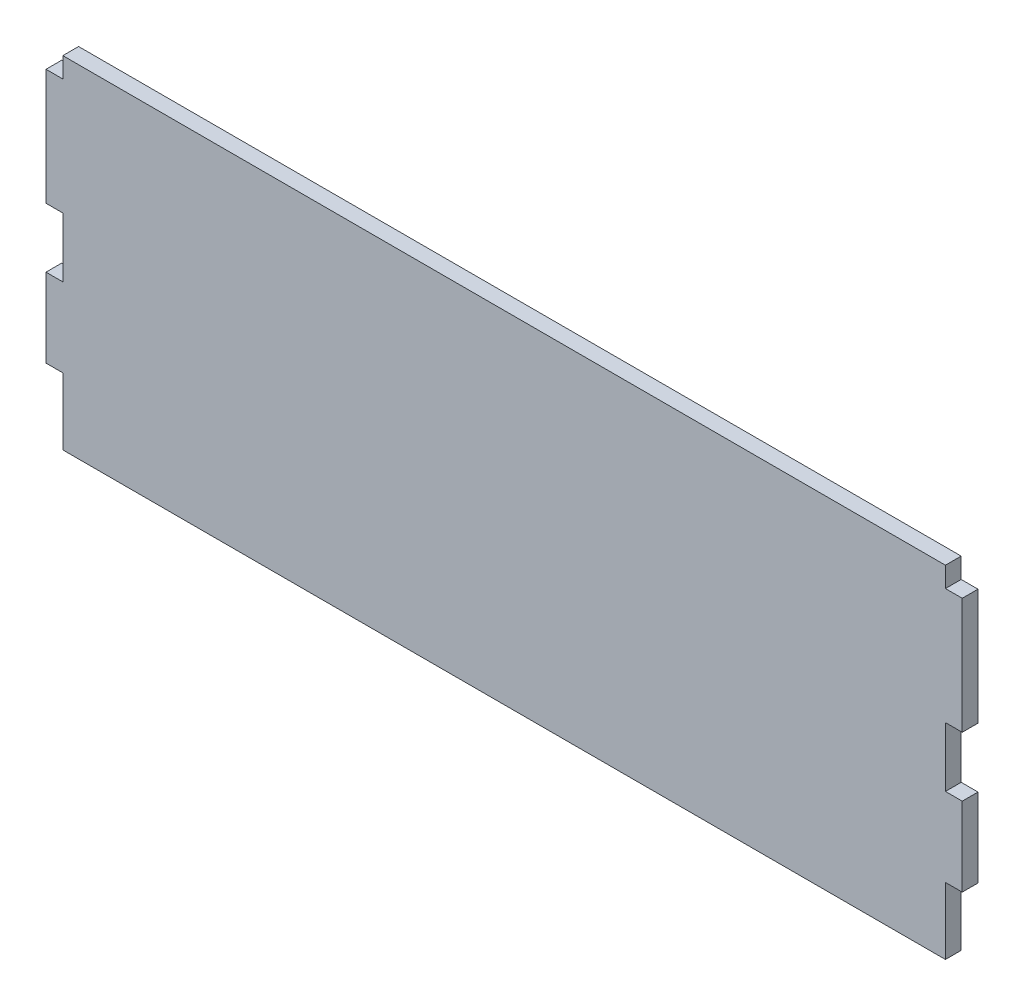
ISO-10303-21;
HEADER;
FILE_DESCRIPTION(('STEP AP214'),'2;1');
FILE_NAME('part.step','',(''),(''),'','','');
FILE_SCHEMA(('AUTOMOTIVE_DESIGN { 1 0 10303 214 1 1 1 1 }'));
ENDSEC;
DATA;
#1=APPLICATION_CONTEXT('core data for automotive mechanical design processes');
#2=APPLICATION_PROTOCOL_DEFINITION('international standard','automotive_design',2000,#1);
#3=PRODUCT_CONTEXT('',#1,'mechanical');
#4=PRODUCT('Part','Part','',(#3));
#5=PRODUCT_RELATED_PRODUCT_CATEGORY('part','',(#4));
#6=PRODUCT_DEFINITION_FORMATION('','',#4);
#7=PRODUCT_DEFINITION_CONTEXT('part definition',#1,'design');
#8=PRODUCT_DEFINITION('design','',#6,#7);
#9=PRODUCT_DEFINITION_SHAPE('','',#8);
#10=(LENGTH_UNIT() NAMED_UNIT(*) SI_UNIT(.MILLI.,.METRE.));
#11=(NAMED_UNIT(*) PLANE_ANGLE_UNIT() SI_UNIT($,.RADIAN.));
#12=(NAMED_UNIT(*) SI_UNIT($,.STERADIAN.) SOLID_ANGLE_UNIT());
#13=UNCERTAINTY_MEASURE_WITH_UNIT(LENGTH_MEASURE(1.E-05),#10,'distance_accuracy_value','');
#14=(GEOMETRIC_REPRESENTATION_CONTEXT(3) GLOBAL_UNCERTAINTY_ASSIGNED_CONTEXT((#13)) GLOBAL_UNIT_ASSIGNED_CONTEXT((#10,
#11,#12)) REPRESENTATION_CONTEXT('',''));
#15=CARTESIAN_POINT('',(0.,0.,0.));
#16=DIRECTION('',(0.,0.,1.));
#17=DIRECTION('',(1.,0.,0.));
#18=AXIS2_PLACEMENT_3D('',#15,#16,#17);
#19=CARTESIAN_POINT('',(-84.,11.1478908984833,3.));
#20=DIRECTION('',(1.,0.,0.));
#21=DIRECTION('',(0.,0.,-1.));
#22=AXIS2_PLACEMENT_3D('',#19,#20,#21);
#23=PLANE('',#22);
#24=DIRECTION('',(0.,-1.,0.));
#25=VECTOR('',#24,1.);
#26=CARTESIAN_POINT('',(-84.,11.1478908984833,3.));
#27=LINE('',#26,#25);
#28=CARTESIAN_POINT('',(-84.,14.9988424174287,3.));
#29=VERTEX_POINT('',#28);
#30=CARTESIAN_POINT('',(-84.,11.1478908984833,3.));
#31=VERTEX_POINT('',#30);
#32=EDGE_CURVE('E137',#29,#31,#27,.T.);
#33=ORIENTED_EDGE('',*,*,#32,.F.);
#34=DIRECTION('',(0.,0.,-1.));
#35=VECTOR('',#34,1.);
#36=CARTESIAN_POINT('',(-84.,14.9988424174287,3.));
#37=LINE('',#36,#35);
#38=CARTESIAN_POINT('',(-84.,14.9988424174287,0.));
#39=VERTEX_POINT('',#38);
#40=EDGE_CURVE('E222',#29,#39,#37,.T.);
#41=ORIENTED_EDGE('',*,*,#40,.T.);
#42=DIRECTION('',(0.,-1.,0.));
#43=VECTOR('',#42,1.);
#44=CARTESIAN_POINT('',(-84.,11.1478908984833,0.));
#45=LINE('',#44,#43);
#46=CARTESIAN_POINT('',(-84.,11.1478908984833,0.));
#47=VERTEX_POINT('',#46);
#48=EDGE_CURVE('E218',#39,#47,#45,.T.);
#49=ORIENTED_EDGE('',*,*,#48,.T.);
#50=DIRECTION('',(0.,0.,-1.));
#51=VECTOR('',#50,1.);
#52=CARTESIAN_POINT('',(-84.,11.1478908984833,3.));
#53=LINE('',#52,#51);
#54=EDGE_CURVE('E51',#31,#47,#53,.T.);
#55=ORIENTED_EDGE('',*,*,#54,.F.);
#56=EDGE_LOOP('',(#33,#41,#49,#55));
#57=FACE_BOUND('',#56,.T.);
#58=ADVANCED_FACE('F43',(#57),#23,.F.);
#59=CARTESIAN_POINT('',(-84.,11.1478908984833,3.));
#60=DIRECTION('',(0.,-1.,0.));
#61=DIRECTION('',(0.,0.,-1.));
#62=AXIS2_PLACEMENT_3D('',#59,#60,#61);
#63=PLANE('',#62);
#64=DIRECTION('',(-1.,0.,0.));
#65=VECTOR('',#64,1.);
#66=CARTESIAN_POINT('',(-84.,11.1478908984833,0.));
#67=LINE('',#66,#65);
#68=CARTESIAN_POINT('',(-87.2,11.1478908984833,0.));
#69=VERTEX_POINT('',#68);
#70=EDGE_CURVE('E221',#47,#69,#67,.T.);
#71=ORIENTED_EDGE('',*,*,#70,.T.);
#72=DIRECTION('',(0.,0.,-1.));
#73=VECTOR('',#72,1.);
#74=CARTESIAN_POINT('',(-87.2,11.1478908984833,3.));
#75=LINE('',#74,#73);
#76=CARTESIAN_POINT('',(-87.2,11.1478908984833,3.));
#77=VERTEX_POINT('',#76);
#78=EDGE_CURVE('E329',#77,#69,#75,.T.);
#79=ORIENTED_EDGE('',*,*,#78,.F.);
#80=DIRECTION('',(-1.,0.,0.));
#81=VECTOR('',#80,1.);
#82=CARTESIAN_POINT('',(-84.,11.1478908984833,3.));
#83=LINE('',#82,#81);
#84=EDGE_CURVE('E339',#31,#77,#83,.T.);
#85=ORIENTED_EDGE('',*,*,#84,.F.);
#86=ORIENTED_EDGE('',*,*,#54,.T.);
#87=EDGE_LOOP('',(#71,#79,#85,#86));
#88=FACE_BOUND('',#87,.T.);
#89=ADVANCED_FACE('F337',(#88),#63,.F.);
#90=CARTESIAN_POINT('',(-87.2,11.1478908984833,3.));
#91=DIRECTION('',(1.,0.,0.));
#92=DIRECTION('',(0.,0.,-1.));
#93=AXIS2_PLACEMENT_3D('',#90,#91,#92);
#94=PLANE('',#93);
#95=DIRECTION('',(0.,-1.,0.));
#96=VECTOR('',#95,1.);
#97=CARTESIAN_POINT('',(-87.2,11.1478908984833,0.));
#98=LINE('',#97,#96);
#99=CARTESIAN_POINT('',(-87.2,-10.9453908984831,0.));
#100=VERTEX_POINT('',#99);
#101=EDGE_CURVE('E225',#69,#100,#98,.T.);
#102=ORIENTED_EDGE('',*,*,#101,.T.);
#103=DIRECTION('',(0.,0.,-1.));
#104=VECTOR('',#103,1.);
#105=CARTESIAN_POINT('',(-87.2,-10.9453908984831,3.));
#106=LINE('',#105,#104);
#107=CARTESIAN_POINT('',(-87.2,-10.9453908984831,3.));
#108=VERTEX_POINT('',#107);
#109=EDGE_CURVE('E325',#108,#100,#106,.T.);
#110=ORIENTED_EDGE('',*,*,#109,.F.);
#111=DIRECTION('',(0.,-1.,0.));
#112=VECTOR('',#111,1.);
#113=CARTESIAN_POINT('',(-87.2,11.1478908984833,3.));
#114=LINE('',#113,#112);
#115=EDGE_CURVE('E359',#77,#108,#114,.T.);
#116=ORIENTED_EDGE('',*,*,#115,.F.);
#117=ORIENTED_EDGE('',*,*,#78,.T.);
#118=EDGE_LOOP('',(#102,#110,#116,#117));
#119=FACE_BOUND('',#118,.T.);
#120=ADVANCED_FACE('F349',(#119),#94,.F.);
#121=CARTESIAN_POINT('',(-87.2,-10.9453908984831,3.));
#122=DIRECTION('',(0.,1.,0.));
#123=DIRECTION('',(0.,0.,1.));
#124=AXIS2_PLACEMENT_3D('',#121,#122,#123);
#125=PLANE('',#124);
#126=DIRECTION('',(1.,0.,0.));
#127=VECTOR('',#126,1.);
#128=CARTESIAN_POINT('',(-87.2,-10.9453908984831,0.));
#129=LINE('',#128,#127);
#130=CARTESIAN_POINT('',(-84.,-10.9453908984831,0.));
#131=VERTEX_POINT('',#130);
#132=EDGE_CURVE('E228',#100,#131,#129,.T.);
#133=ORIENTED_EDGE('',*,*,#132,.T.);
#134=DIRECTION('',(0.,0.,-1.));
#135=VECTOR('',#134,1.);
#136=CARTESIAN_POINT('',(-84.,-10.9453908984831,3.));
#137=LINE('',#136,#135);
#138=CARTESIAN_POINT('',(-84.,-10.9453908984831,3.));
#139=VERTEX_POINT('',#138);
#140=EDGE_CURVE('E321',#139,#131,#137,.T.);
#141=ORIENTED_EDGE('',*,*,#140,.F.);
#142=DIRECTION('',(1.,0.,0.));
#143=VECTOR('',#142,1.);
#144=CARTESIAN_POINT('',(-87.2,-10.9453908984831,3.));
#145=LINE('',#144,#143);
#146=EDGE_CURVE('E355',#108,#139,#145,.T.);
#147=ORIENTED_EDGE('',*,*,#146,.F.);
#148=ORIENTED_EDGE('',*,*,#109,.T.);
#149=EDGE_LOOP('',(#133,#141,#147,#148));
#150=FACE_BOUND('',#149,.T.);
#151=ADVANCED_FACE('F353',(#150),#125,.F.);
#152=CARTESIAN_POINT('',(-84.,-22.2953908984831,3.));
#153=DIRECTION('',(1.,0.,0.));
#154=DIRECTION('',(0.,0.,-1.));
#155=AXIS2_PLACEMENT_3D('',#152,#153,#154);
#156=PLANE('',#155);
#157=DIRECTION('',(0.,-1.,0.));
#158=VECTOR('',#157,1.);
#159=CARTESIAN_POINT('',(-84.,-22.2953908984831,0.));
#160=LINE('',#159,#158);
#161=CARTESIAN_POINT('',(-84.,-22.2953908984831,0.));
#162=VERTEX_POINT('',#161);
#163=EDGE_CURVE('E231',#131,#162,#160,.T.);
#164=ORIENTED_EDGE('',*,*,#163,.T.);
#165=DIRECTION('',(0.,0.,-1.));
#166=VECTOR('',#165,1.);
#167=CARTESIAN_POINT('',(-84.,-22.2953908984831,3.));
#168=LINE('',#167,#166);
#169=CARTESIAN_POINT('',(-84.,-22.2953908984831,3.));
#170=VERTEX_POINT('',#169);
#171=EDGE_CURVE('E317',#170,#162,#168,.T.);
#172=ORIENTED_EDGE('',*,*,#171,.F.);
#173=DIRECTION('',(0.,-1.,0.));
#174=VECTOR('',#173,1.);
#175=CARTESIAN_POINT('',(-84.,-22.2953908984831,3.));
#176=LINE('',#175,#174);
#177=EDGE_CURVE('E358',#139,#170,#176,.T.);
#178=ORIENTED_EDGE('',*,*,#177,.F.);
#179=ORIENTED_EDGE('',*,*,#140,.T.);
#180=EDGE_LOOP('',(#164,#172,#178,#179));
#181=FACE_BOUND('',#180,.T.);
#182=ADVANCED_FACE('F436',(#181),#156,.F.);
#183=CARTESIAN_POINT('',(-87.2,-22.2953908984831,3.));
#184=DIRECTION('',(0.,-1.,0.));
#185=DIRECTION('',(0.,0.,-1.));
#186=AXIS2_PLACEMENT_3D('',#183,#184,#185);
#187=PLANE('',#186);
#188=DIRECTION('',(-1.,0.,0.));
#189=VECTOR('',#188,1.);
#190=CARTESIAN_POINT('',(-87.2,-22.2953908984831,0.));
#191=LINE('',#190,#189);
#192=CARTESIAN_POINT('',(-87.2,-22.2953908984831,0.));
#193=VERTEX_POINT('',#192);
#194=EDGE_CURVE('E234',#162,#193,#191,.T.);
#195=ORIENTED_EDGE('',*,*,#194,.T.);
#196=DIRECTION('',(0.,0.,-1.));
#197=VECTOR('',#196,1.);
#198=CARTESIAN_POINT('',(-87.2,-22.2953908984831,3.));
#199=LINE('',#198,#197);
#200=CARTESIAN_POINT('',(-87.2,-22.2953908984831,3.));
#201=VERTEX_POINT('',#200);
#202=EDGE_CURVE('E313',#201,#193,#199,.T.);
#203=ORIENTED_EDGE('',*,*,#202,.F.);
#204=DIRECTION('',(-1.,0.,0.));
#205=VECTOR('',#204,1.);
#206=CARTESIAN_POINT('',(-87.2,-22.2953908984831,3.));
#207=LINE('',#206,#205);
#208=EDGE_CURVE('E363',#170,#201,#207,.T.);
#209=ORIENTED_EDGE('',*,*,#208,.F.);
#210=ORIENTED_EDGE('',*,*,#171,.T.);
#211=EDGE_LOOP('',(#195,#203,#209,#210));
#212=FACE_BOUND('',#211,.T.);
#213=ADVANCED_FACE('F439',(#212),#187,.F.);
#214=CARTESIAN_POINT('',(-87.2,-37.2953908984831,3.));
#215=DIRECTION('',(1.,0.,0.));
#216=DIRECTION('',(0.,1.,0.));
#217=AXIS2_PLACEMENT_3D('',#214,#215,#216);
#218=PLANE('',#217);
#219=DIRECTION('',(0.,-1.,0.));
#220=VECTOR('',#219,1.);
#221=CARTESIAN_POINT('',(-87.2,-37.2953908984831,0.));
#222=LINE('',#221,#220);
#223=CARTESIAN_POINT('',(-87.2,-37.2953908984831,0.));
#224=VERTEX_POINT('',#223);
#225=EDGE_CURVE('E237',#193,#224,#222,.T.);
#226=ORIENTED_EDGE('',*,*,#225,.T.);
#227=DIRECTION('',(0.,0.,-1.));
#228=VECTOR('',#227,1.);
#229=CARTESIAN_POINT('',(-87.2,-37.2953908984831,3.));
#230=LINE('',#229,#228);
#231=CARTESIAN_POINT('',(-87.2,-37.2953908984831,3.));
#232=VERTEX_POINT('',#231);
#233=EDGE_CURVE('E309',#232,#224,#230,.T.);
#234=ORIENTED_EDGE('',*,*,#233,.F.);
#235=DIRECTION('',(0.,-1.,0.));
#236=VECTOR('',#235,1.);
#237=CARTESIAN_POINT('',(-87.2,-37.2953908984831,3.));
#238=LINE('',#237,#236);
#239=EDGE_CURVE('E370',#201,#232,#238,.T.);
#240=ORIENTED_EDGE('',*,*,#239,.F.);
#241=ORIENTED_EDGE('',*,*,#202,.T.);
#242=EDGE_LOOP('',(#226,#234,#240,#241));
#243=FACE_BOUND('',#242,.T.);
#244=ADVANCED_FACE('F443',(#243),#218,.F.);
#245=CARTESIAN_POINT('',(-84.,-37.2953908984831,3.));
#246=DIRECTION('',(0.,1.,0.));
#247=DIRECTION('',(-1.,0.,0.));
#248=AXIS2_PLACEMENT_3D('',#245,#246,#247);
#249=PLANE('',#248);
#250=DIRECTION('',(1.,0.,0.));
#251=VECTOR('',#250,1.);
#252=CARTESIAN_POINT('',(-84.,-37.2953908984831,0.));
#253=LINE('',#252,#251);
#254=CARTESIAN_POINT('',(-84.,-37.2953908984831,0.));
#255=VERTEX_POINT('',#254);
#256=EDGE_CURVE('E240',#224,#255,#253,.T.);
#257=ORIENTED_EDGE('',*,*,#256,.T.);
#258=DIRECTION('',(0.,0.,-1.));
#259=VECTOR('',#258,1.);
#260=CARTESIAN_POINT('',(-84.,-37.2953908984831,3.));
#261=LINE('',#260,#259);
#262=CARTESIAN_POINT('',(-84.,-37.2953908984831,3.));
#263=VERTEX_POINT('',#262);
#264=EDGE_CURVE('E305',#263,#255,#261,.T.);
#265=ORIENTED_EDGE('',*,*,#264,.F.);
#266=DIRECTION('',(1.,0.,0.));
#267=VECTOR('',#266,1.);
#268=CARTESIAN_POINT('',(-84.,-37.2953908984831,3.));
#269=LINE('',#268,#267);
#270=EDGE_CURVE('E373',#232,#263,#269,.T.);
#271=ORIENTED_EDGE('',*,*,#270,.F.);
#272=ORIENTED_EDGE('',*,*,#233,.T.);
#273=EDGE_LOOP('',(#257,#265,#271,#272));
#274=FACE_BOUND('',#273,.T.);
#275=ADVANCED_FACE('F447',(#274),#249,.F.);
#276=CARTESIAN_POINT('',(-84.,-50.,3.));
#277=DIRECTION('',(1.,0.,0.));
#278=DIRECTION('',(0.,1.,0.));
#279=AXIS2_PLACEMENT_3D('',#276,#277,#278);
#280=PLANE('',#279);
#281=DIRECTION('',(0.,-1.,0.));
#282=VECTOR('',#281,1.);
#283=CARTESIAN_POINT('',(-84.,-50.,0.));
#284=LINE('',#283,#282);
#285=CARTESIAN_POINT('',(-84.,-50.,0.));
#286=VERTEX_POINT('',#285);
#287=EDGE_CURVE('E243',#255,#286,#284,.T.);
#288=ORIENTED_EDGE('',*,*,#287,.T.);
#289=DIRECTION('',(0.,0.,-1.));
#290=VECTOR('',#289,1.);
#291=CARTESIAN_POINT('',(-84.,-50.,3.));
#292=LINE('',#291,#290);
#293=CARTESIAN_POINT('',(-84.,-50.,3.));
#294=VERTEX_POINT('',#293);
#295=EDGE_CURVE('E301',#294,#286,#292,.T.);
#296=ORIENTED_EDGE('',*,*,#295,.F.);
#297=DIRECTION('',(0.,-1.,0.));
#298=VECTOR('',#297,1.);
#299=CARTESIAN_POINT('',(-84.,-50.,3.));
#300=LINE('',#299,#298);
#301=EDGE_CURVE('E376',#263,#294,#300,.T.);
#302=ORIENTED_EDGE('',*,*,#301,.F.);
#303=ORIENTED_EDGE('',*,*,#264,.T.);
#304=EDGE_LOOP('',(#288,#296,#302,#303));
#305=FACE_BOUND('',#304,.T.);
#306=ADVANCED_FACE('F451',(#305),#280,.F.);
#307=CARTESIAN_POINT('',(84.,-50.,3.));
#308=DIRECTION('',(0.,1.,0.));
#309=DIRECTION('',(0.,0.,1.));
#310=AXIS2_PLACEMENT_3D('',#307,#308,#309);
#311=PLANE('',#310);
#312=DIRECTION('',(1.,0.,0.));
#313=VECTOR('',#312,1.);
#314=CARTESIAN_POINT('',(84.,-50.,0.));
#315=LINE('',#314,#313);
#316=CARTESIAN_POINT('',(84.,-50.,0.));
#317=VERTEX_POINT('',#316);
#318=EDGE_CURVE('E246',#286,#317,#315,.T.);
#319=ORIENTED_EDGE('',*,*,#318,.T.);
#320=DIRECTION('',(0.,0.,-1.));
#321=VECTOR('',#320,1.);
#322=CARTESIAN_POINT('',(84.,-50.,3.));
#323=LINE('',#322,#321);
#324=CARTESIAN_POINT('',(84.,-50.,3.));
#325=VERTEX_POINT('',#324);
#326=EDGE_CURVE('E297',#325,#317,#323,.T.);
#327=ORIENTED_EDGE('',*,*,#326,.F.);
#328=DIRECTION('',(1.,0.,0.));
#329=VECTOR('',#328,1.);
#330=CARTESIAN_POINT('',(84.,-50.,3.));
#331=LINE('',#330,#329);
#332=EDGE_CURVE('E379',#294,#325,#331,.T.);
#333=ORIENTED_EDGE('',*,*,#332,.F.);
#334=ORIENTED_EDGE('',*,*,#295,.T.);
#335=EDGE_LOOP('',(#319,#327,#333,#334));
#336=FACE_BOUND('',#335,.T.);
#337=ADVANCED_FACE('F455',(#336),#311,.F.);
#338=CARTESIAN_POINT('',(84.,-50.,3.));
#339=DIRECTION('',(-1.,0.,0.));
#340=DIRECTION('',(0.,-1.,0.));
#341=AXIS2_PLACEMENT_3D('',#338,#339,#340);
#342=PLANE('',#341);
#343=DIRECTION('',(0.,1.,0.));
#344=VECTOR('',#343,1.);
#345=CARTESIAN_POINT('',(84.,-50.,0.));
#346=LINE('',#345,#344);
#347=CARTESIAN_POINT('',(84.0000000000001,-37.2953908984831,0.));
#348=VERTEX_POINT('',#347);
#349=EDGE_CURVE('E249',#317,#348,#346,.T.);
#350=ORIENTED_EDGE('',*,*,#349,.T.);
#351=DIRECTION('',(0.,0.,-1.));
#352=VECTOR('',#351,1.);
#353=CARTESIAN_POINT('',(84.0000000000001,-37.2953908984831,3.));
#354=LINE('',#353,#352);
#355=CARTESIAN_POINT('',(84.0000000000001,-37.2953908984831,3.));
#356=VERTEX_POINT('',#355);
#357=EDGE_CURVE('E293',#356,#348,#354,.T.);
#358=ORIENTED_EDGE('',*,*,#357,.F.);
#359=DIRECTION('',(0.,1.,0.));
#360=VECTOR('',#359,1.);
#361=CARTESIAN_POINT('',(84.,-50.,3.));
#362=LINE('',#361,#360);
#363=EDGE_CURVE('E382',#325,#356,#362,.T.);
#364=ORIENTED_EDGE('',*,*,#363,.F.);
#365=ORIENTED_EDGE('',*,*,#326,.T.);
#366=EDGE_LOOP('',(#350,#358,#364,#365));
#367=FACE_BOUND('',#366,.T.);
#368=ADVANCED_FACE('F459',(#367),#342,.F.);
#369=CARTESIAN_POINT('',(84.0000000000001,-37.2953908984831,3.));
#370=DIRECTION('',(0.,1.,0.));
#371=DIRECTION('',(-1.,0.,0.));
#372=AXIS2_PLACEMENT_3D('',#369,#370,#371);
#373=PLANE('',#372);
#374=DIRECTION('',(1.,0.,0.));
#375=VECTOR('',#374,1.);
#376=CARTESIAN_POINT('',(84.0000000000001,-37.2953908984831,0.));
#377=LINE('',#376,#375);
#378=CARTESIAN_POINT('',(87.2000000000001,-37.2953908984831,0.));
#379=VERTEX_POINT('',#378);
#380=EDGE_CURVE('E252',#348,#379,#377,.T.);
#381=ORIENTED_EDGE('',*,*,#380,.T.);
#382=DIRECTION('',(0.,0.,-1.));
#383=VECTOR('',#382,1.);
#384=CARTESIAN_POINT('',(87.2000000000001,-37.2953908984831,3.));
#385=LINE('',#384,#383);
#386=CARTESIAN_POINT('',(87.2000000000001,-37.2953908984831,3.));
#387=VERTEX_POINT('',#386);
#388=EDGE_CURVE('E289',#387,#379,#385,.T.);
#389=ORIENTED_EDGE('',*,*,#388,.F.);
#390=DIRECTION('',(1.,0.,0.));
#391=VECTOR('',#390,1.);
#392=CARTESIAN_POINT('',(84.0000000000001,-37.2953908984831,3.));
#393=LINE('',#392,#391);
#394=EDGE_CURVE('E385',#356,#387,#393,.T.);
#395=ORIENTED_EDGE('',*,*,#394,.F.);
#396=ORIENTED_EDGE('',*,*,#357,.T.);
#397=EDGE_LOOP('',(#381,#389,#395,#396));
#398=FACE_BOUND('',#397,.T.);
#399=ADVANCED_FACE('F463',(#398),#373,.F.);
#400=CARTESIAN_POINT('',(87.2000000000001,-37.2953908984831,3.));
#401=DIRECTION('',(-1.,0.,0.));
#402=DIRECTION('',(0.,-1.,0.));
#403=AXIS2_PLACEMENT_3D('',#400,#401,#402);
#404=PLANE('',#403);
#405=DIRECTION('',(0.,1.,0.));
#406=VECTOR('',#405,1.);
#407=CARTESIAN_POINT('',(87.2000000000001,-37.2953908984831,0.));
#408=LINE('',#407,#406);
#409=CARTESIAN_POINT('',(87.2000000000001,-22.2953908984831,0.));
#410=VERTEX_POINT('',#409);
#411=EDGE_CURVE('E255',#379,#410,#408,.T.);
#412=ORIENTED_EDGE('',*,*,#411,.T.);
#413=DIRECTION('',(0.,0.,-1.));
#414=VECTOR('',#413,1.);
#415=CARTESIAN_POINT('',(87.2000000000001,-22.2953908984831,3.));
#416=LINE('',#415,#414);
#417=CARTESIAN_POINT('',(87.2000000000001,-22.2953908984831,3.));
#418=VERTEX_POINT('',#417);
#419=EDGE_CURVE('E285',#418,#410,#416,.T.);
#420=ORIENTED_EDGE('',*,*,#419,.F.);
#421=DIRECTION('',(0.,1.,0.));
#422=VECTOR('',#421,1.);
#423=CARTESIAN_POINT('',(87.2000000000001,-37.2953908984831,3.));
#424=LINE('',#423,#422);
#425=EDGE_CURVE('E388',#387,#418,#424,.T.);
#426=ORIENTED_EDGE('',*,*,#425,.F.);
#427=ORIENTED_EDGE('',*,*,#388,.T.);
#428=EDGE_LOOP('',(#412,#420,#426,#427));
#429=FACE_BOUND('',#428,.T.);
#430=ADVANCED_FACE('F467',(#429),#404,.F.);
#431=CARTESIAN_POINT('',(87.2000000000001,-22.2953908984831,3.));
#432=DIRECTION('',(0.,-1.,0.));
#433=DIRECTION('',(0.,0.,-1.));
#434=AXIS2_PLACEMENT_3D('',#431,#432,#433);
#435=PLANE('',#434);
#436=DIRECTION('',(-1.,0.,0.));
#437=VECTOR('',#436,1.);
#438=CARTESIAN_POINT('',(87.2000000000001,-22.2953908984831,0.));
#439=LINE('',#438,#437);
#440=CARTESIAN_POINT('',(84.0000000000001,-22.2953908984831,0.));
#441=VERTEX_POINT('',#440);
#442=EDGE_CURVE('E258',#410,#441,#439,.T.);
#443=ORIENTED_EDGE('',*,*,#442,.T.);
#444=DIRECTION('',(0.,0.,-1.));
#445=VECTOR('',#444,1.);
#446=CARTESIAN_POINT('',(84.0000000000001,-22.2953908984831,3.));
#447=LINE('',#446,#445);
#448=CARTESIAN_POINT('',(84.0000000000001,-22.2953908984831,3.));
#449=VERTEX_POINT('',#448);
#450=EDGE_CURVE('E281',#449,#441,#447,.T.);
#451=ORIENTED_EDGE('',*,*,#450,.F.);
#452=DIRECTION('',(-1.,0.,0.));
#453=VECTOR('',#452,1.);
#454=CARTESIAN_POINT('',(87.2000000000001,-22.2953908984831,3.));
#455=LINE('',#454,#453);
#456=EDGE_CURVE('E391',#418,#449,#455,.T.);
#457=ORIENTED_EDGE('',*,*,#456,.F.);
#458=ORIENTED_EDGE('',*,*,#419,.T.);
#459=EDGE_LOOP('',(#443,#451,#457,#458));
#460=FACE_BOUND('',#459,.T.);
#461=ADVANCED_FACE('F399',(#460),#435,.F.);
#462=CARTESIAN_POINT('',(84.0000000000001,-22.2953908984831,3.));
#463=DIRECTION('',(-1.,0.,0.));
#464=DIRECTION('',(0.,-1.,0.));
#465=AXIS2_PLACEMENT_3D('',#462,#463,#464);
#466=PLANE('',#465);
#467=DIRECTION('',(0.,1.,0.));
#468=VECTOR('',#467,1.);
#469=CARTESIAN_POINT('',(84.0000000000001,-22.2953908984831,0.));
#470=LINE('',#469,#468);
#471=CARTESIAN_POINT('',(84.,-10.945390898483,0.));
#472=VERTEX_POINT('',#471);
#473=EDGE_CURVE('E261',#441,#472,#470,.T.);
#474=ORIENTED_EDGE('',*,*,#473,.T.);
#475=DIRECTION('',(0.,0.,-1.));
#476=VECTOR('',#475,1.);
#477=CARTESIAN_POINT('',(84.,-10.945390898483,3.));
#478=LINE('',#477,#476);
#479=CARTESIAN_POINT('',(84.,-10.945390898483,3.));
#480=VERTEX_POINT('',#479);
#481=EDGE_CURVE('E204',#480,#472,#478,.T.);
#482=ORIENTED_EDGE('',*,*,#481,.F.);
#483=DIRECTION('',(0.,1.,0.));
#484=VECTOR('',#483,1.);
#485=CARTESIAN_POINT('',(84.0000000000001,-22.2953908984831,3.));
#486=LINE('',#485,#484);
#487=EDGE_CURVE('E190',#449,#480,#486,.T.);
#488=ORIENTED_EDGE('',*,*,#487,.F.);
#489=ORIENTED_EDGE('',*,*,#450,.T.);
#490=EDGE_LOOP('',(#474,#482,#488,#489));
#491=FACE_BOUND('',#490,.T.);
#492=ADVANCED_FACE('F403',(#491),#466,.F.);
#493=CARTESIAN_POINT('',(87.2,-10.945390898483,3.));
#494=DIRECTION('',(0.,1.,0.));
#495=DIRECTION('',(0.,0.,1.));
#496=AXIS2_PLACEMENT_3D('',#493,#494,#495);
#497=PLANE('',#496);
#498=DIRECTION('',(1.,0.,0.));
#499=VECTOR('',#498,1.);
#500=CARTESIAN_POINT('',(87.2,-10.945390898483,0.));
#501=LINE('',#500,#499);
#502=CARTESIAN_POINT('',(87.2,-10.945390898483,0.));
#503=VERTEX_POINT('',#502);
#504=EDGE_CURVE('E200',#472,#503,#501,.T.);
#505=ORIENTED_EDGE('',*,*,#504,.T.);
#506=DIRECTION('',(0.,0.,-1.));
#507=VECTOR('',#506,1.);
#508=CARTESIAN_POINT('',(87.2,-10.945390898483,3.));
#509=LINE('',#508,#507);
#510=CARTESIAN_POINT('',(87.2,-10.945390898483,3.));
#511=VERTEX_POINT('',#510);
#512=EDGE_CURVE('E197',#511,#503,#509,.T.);
#513=ORIENTED_EDGE('',*,*,#512,.F.);
#514=DIRECTION('',(1.,0.,0.));
#515=VECTOR('',#514,1.);
#516=CARTESIAN_POINT('',(87.2,-10.945390898483,3.));
#517=LINE('',#516,#515);
#518=EDGE_CURVE('E183',#480,#511,#517,.T.);
#519=ORIENTED_EDGE('',*,*,#518,.F.);
#520=ORIENTED_EDGE('',*,*,#481,.T.);
#521=EDGE_LOOP('',(#505,#513,#519,#520));
#522=FACE_BOUND('',#521,.T.);
#523=ADVANCED_FACE('F198',(#522),#497,.F.);
#524=CARTESIAN_POINT('',(87.2000000000001,11.1478908984833,3.));
#525=DIRECTION('',(-1.,0.,0.));
#526=DIRECTION('',(0.,-1.,0.));
#527=AXIS2_PLACEMENT_3D('',#524,#525,#526);
#528=PLANE('',#527);
#529=DIRECTION('',(0.,1.,0.));
#530=VECTOR('',#529,1.);
#531=CARTESIAN_POINT('',(87.2000000000001,11.1478908984833,0.));
#532=LINE('',#531,#530);
#533=CARTESIAN_POINT('',(87.2000000000001,11.1478908984833,0.));
#534=VERTEX_POINT('',#533);
#535=EDGE_CURVE('E266',#503,#534,#532,.T.);
#536=ORIENTED_EDGE('',*,*,#535,.T.);
#537=DIRECTION('',(0.,0.,-1.));
#538=VECTOR('',#537,1.);
#539=CARTESIAN_POINT('',(87.2000000000001,11.1478908984833,3.));
#540=LINE('',#539,#538);
#541=CARTESIAN_POINT('',(87.2000000000001,11.1478908984833,3.));
#542=VERTEX_POINT('',#541);
#543=EDGE_CURVE('E205',#542,#534,#540,.T.);
#544=ORIENTED_EDGE('',*,*,#543,.F.);
#545=DIRECTION('',(0.,1.,0.));
#546=VECTOR('',#545,1.);
#547=CARTESIAN_POINT('',(87.2000000000001,11.1478908984833,3.));
#548=LINE('',#547,#546);
#549=EDGE_CURVE('E187',#511,#542,#548,.T.);
#550=ORIENTED_EDGE('',*,*,#549,.F.);
#551=ORIENTED_EDGE('',*,*,#512,.T.);
#552=EDGE_LOOP('',(#536,#544,#550,#551));
#553=FACE_BOUND('',#552,.T.);
#554=ADVANCED_FACE('F207',(#553),#528,.F.);
#555=CARTESIAN_POINT('',(84.0000000000001,11.1478908984833,3.));
#556=DIRECTION('',(0.,-1.,0.));
#557=DIRECTION('',(0.,0.,-1.));
#558=AXIS2_PLACEMENT_3D('',#555,#556,#557);
#559=PLANE('',#558);
#560=DIRECTION('',(-1.,0.,0.));
#561=VECTOR('',#560,1.);
#562=CARTESIAN_POINT('',(84.0000000000001,11.1478908984833,0.));
#563=LINE('',#562,#561);
#564=CARTESIAN_POINT('',(84.0000000000001,11.1478908984833,0.));
#565=VERTEX_POINT('',#564);
#566=EDGE_CURVE('E129',#534,#565,#563,.T.);
#567=ORIENTED_EDGE('',*,*,#566,.T.);
#568=DIRECTION('',(0.,0.,-1.));
#569=VECTOR('',#568,1.);
#570=CARTESIAN_POINT('',(84.0000000000001,11.1478908984833,3.));
#571=LINE('',#570,#569);
#572=CARTESIAN_POINT('',(84.0000000000001,11.1478908984833,3.));
#573=VERTEX_POINT('',#572);
#574=EDGE_CURVE('E217',#573,#565,#571,.T.);
#575=ORIENTED_EDGE('',*,*,#574,.F.);
#576=DIRECTION('',(-1.,0.,0.));
#577=VECTOR('',#576,1.);
#578=CARTESIAN_POINT('',(84.0000000000001,11.1478908984833,3.));
#579=LINE('',#578,#577);
#580=EDGE_CURVE('E66',#542,#573,#579,.T.);
#581=ORIENTED_EDGE('',*,*,#580,.F.);
#582=ORIENTED_EDGE('',*,*,#543,.T.);
#583=EDGE_LOOP('',(#567,#575,#581,#582));
#584=FACE_BOUND('',#583,.T.);
#585=ADVANCED_FACE('F405',(#584),#559,.F.);
#586=CARTESIAN_POINT('',(84.0000000000001,11.1478908984833,3.));
#587=DIRECTION('',(-1.,0.,0.));
#588=DIRECTION('',(0.,0.,1.));
#589=AXIS2_PLACEMENT_3D('',#586,#587,#588);
#590=PLANE('',#589);
#591=DIRECTION('',(0.,1.,0.));
#592=VECTOR('',#591,1.);
#593=CARTESIAN_POINT('',(84.0000000000001,11.1478908984833,0.));
#594=LINE('',#593,#592);
#595=CARTESIAN_POINT('',(84.0000000000001,14.9988424174287,0.));
#596=VERTEX_POINT('',#595);
#597=EDGE_CURVE('E271',#565,#596,#594,.T.);
#598=ORIENTED_EDGE('',*,*,#597,.T.);
#599=DIRECTION('',(0.,0.,1.));
#600=VECTOR('',#599,1.);
#601=CARTESIAN_POINT('',(84.0000000000001,14.9988424174287,3.));
#602=LINE('',#601,#600);
#603=CARTESIAN_POINT('',(84.0000000000001,14.9988424174287,3.));
#604=VERTEX_POINT('',#603);
#605=EDGE_CURVE('E58',#596,#604,#602,.T.);
#606=ORIENTED_EDGE('',*,*,#605,.T.);
#607=DIRECTION('',(0.,1.,0.));
#608=VECTOR('',#607,1.);
#609=CARTESIAN_POINT('',(84.0000000000001,11.1478908984833,3.));
#610=LINE('',#609,#608);
#611=EDGE_CURVE('E211',#573,#604,#610,.T.);
#612=ORIENTED_EDGE('',*,*,#611,.F.);
#613=ORIENTED_EDGE('',*,*,#574,.T.);
#614=EDGE_LOOP('',(#598,#606,#612,#613));
#615=FACE_BOUND('',#614,.T.);
#616=ADVANCED_FACE('F408',(#615),#590,.F.);
#617=CARTESIAN_POINT('',(0.,0.,3.));
#618=DIRECTION('',(0.,0.,1.));
#619=DIRECTION('',(1.,0.,0.));
#620=AXIS2_PLACEMENT_3D('',#617,#618,#619);
#621=PLANE('',#620);
#622=DIRECTION('',(1.,0.,0.));
#623=VECTOR('',#622,1.);
#624=CARTESIAN_POINT('',(-90.7019244881686,14.9988424174287,3.));
#625=LINE('',#624,#623);
#626=EDGE_CURVE('E411',#29,#604,#625,.T.);
#627=ORIENTED_EDGE('',*,*,#626,.F.);
#628=ORIENTED_EDGE('',*,*,#32,.T.);
#629=ORIENTED_EDGE('',*,*,#84,.T.);
#630=ORIENTED_EDGE('',*,*,#115,.T.);
#631=ORIENTED_EDGE('',*,*,#146,.T.);
#632=ORIENTED_EDGE('',*,*,#177,.T.);
#633=ORIENTED_EDGE('',*,*,#208,.T.);
#634=ORIENTED_EDGE('',*,*,#239,.T.);
#635=ORIENTED_EDGE('',*,*,#270,.T.);
#636=ORIENTED_EDGE('',*,*,#301,.T.);
#637=ORIENTED_EDGE('',*,*,#332,.T.);
#638=ORIENTED_EDGE('',*,*,#363,.T.);
#639=ORIENTED_EDGE('',*,*,#394,.T.);
#640=ORIENTED_EDGE('',*,*,#425,.T.);
#641=ORIENTED_EDGE('',*,*,#456,.T.);
#642=ORIENTED_EDGE('',*,*,#487,.T.);
#643=ORIENTED_EDGE('',*,*,#518,.T.);
#644=ORIENTED_EDGE('',*,*,#549,.T.);
#645=ORIENTED_EDGE('',*,*,#580,.T.);
#646=ORIENTED_EDGE('',*,*,#611,.T.);
#647=EDGE_LOOP('',(#627,#628,#629,#630,#631,#632,#633,#634,#635,#636,#637,#638,#639,#640,#641,
#642,#643,#644,#645,#646));
#648=FACE_BOUND('',#647,.T.);
#649=ADVANCED_FACE('F185',(#648),#621,.T.);
#650=CARTESIAN_POINT('',(0.,0.,0.));
#651=DIRECTION('',(0.,0.,1.));
#652=DIRECTION('',(1.,0.,0.));
#653=AXIS2_PLACEMENT_3D('',#650,#651,#652);
#654=PLANE('',#653);
#655=ORIENTED_EDGE('',*,*,#48,.F.);
#656=DIRECTION('',(1.,0.,0.));
#657=VECTOR('',#656,1.);
#658=CARTESIAN_POINT('',(0.,14.9988424174287,0.));
#659=LINE('',#658,#657);
#660=EDGE_CURVE('E11',#39,#596,#659,.T.);
#661=ORIENTED_EDGE('',*,*,#660,.T.);
#662=ORIENTED_EDGE('',*,*,#597,.F.);
#663=ORIENTED_EDGE('',*,*,#566,.F.);
#664=ORIENTED_EDGE('',*,*,#535,.F.);
#665=ORIENTED_EDGE('',*,*,#504,.F.);
#666=ORIENTED_EDGE('',*,*,#473,.F.);
#667=ORIENTED_EDGE('',*,*,#442,.F.);
#668=ORIENTED_EDGE('',*,*,#411,.F.);
#669=ORIENTED_EDGE('',*,*,#380,.F.);
#670=ORIENTED_EDGE('',*,*,#349,.F.);
#671=ORIENTED_EDGE('',*,*,#318,.F.);
#672=ORIENTED_EDGE('',*,*,#287,.F.);
#673=ORIENTED_EDGE('',*,*,#256,.F.);
#674=ORIENTED_EDGE('',*,*,#225,.F.);
#675=ORIENTED_EDGE('',*,*,#194,.F.);
#676=ORIENTED_EDGE('',*,*,#163,.F.);
#677=ORIENTED_EDGE('',*,*,#132,.F.);
#678=ORIENTED_EDGE('',*,*,#101,.F.);
#679=ORIENTED_EDGE('',*,*,#70,.F.);
#680=EDGE_LOOP('',(#655,#661,#662,#663,#664,#665,#666,#667,#668,#669,#670,#671,#672,#673,#674,
#675,#676,#677,#678,#679));
#681=FACE_BOUND('',#680,.T.);
#682=ADVANCED_FACE('F344',(#681),#654,.F.);
#683=CARTESIAN_POINT('',(-90.7019244881686,14.9988424174287,0.));
#684=DIRECTION('',(0.,-1.,0.));
#685=DIRECTION('',(0.,0.,-1.));
#686=AXIS2_PLACEMENT_3D('',#683,#684,#685);
#687=PLANE('',#686);
#688=ORIENTED_EDGE('',*,*,#626,.T.);
#689=ORIENTED_EDGE('',*,*,#605,.F.);
#690=ORIENTED_EDGE('',*,*,#660,.F.);
#691=ORIENTED_EDGE('',*,*,#40,.F.);
#692=EDGE_LOOP('',(#688,#689,#690,#691));
#693=FACE_BOUND('',#692,.T.);
#694=ADVANCED_FACE('F415',(#693),#687,.F.);
#695=CLOSED_SHELL('',(#58,#89,#120,#151,#182,#213,#244,#275,#306,#337,#368,#399,#430,#461,#492,
#523,#554,#585,#616,#649,#682,#694));
#696=MANIFOLD_SOLID_BREP('B2',#695);
#697=ADVANCED_BREP_SHAPE_REPRESENTATION('',(#18,#696),#14);
#698=SHAPE_DEFINITION_REPRESENTATION(#9,#697);
ENDSEC;
END-ISO-10303-21;
